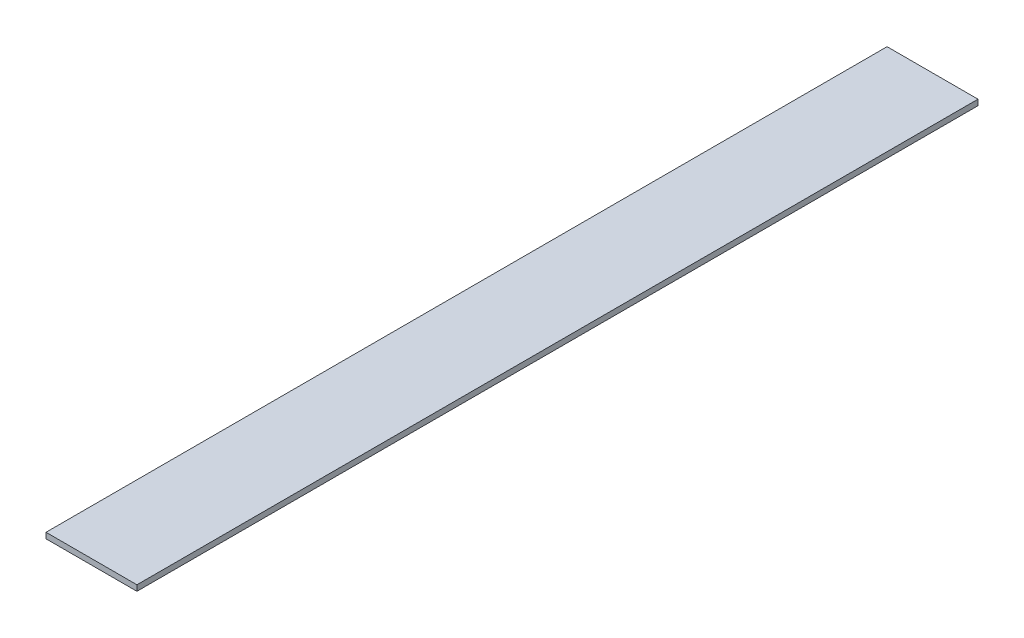
ISO-10303-21;
HEADER;
FILE_DESCRIPTION(('STEP AP214'),'2;1');
FILE_NAME('part.step','',(''),(''),'','','');
FILE_SCHEMA(('AUTOMOTIVE_DESIGN { 1 0 10303 214 1 1 1 1 }'));
ENDSEC;
DATA;
#1=APPLICATION_CONTEXT('core data for automotive mechanical design processes');
#2=APPLICATION_PROTOCOL_DEFINITION('international standard','automotive_design',2000,#1);
#3=PRODUCT_CONTEXT('',#1,'mechanical');
#4=PRODUCT('Part','Part','',(#3));
#5=PRODUCT_RELATED_PRODUCT_CATEGORY('part','',(#4));
#6=PRODUCT_DEFINITION_FORMATION('','',#4);
#7=PRODUCT_DEFINITION_CONTEXT('part definition',#1,'design');
#8=PRODUCT_DEFINITION('design','',#6,#7);
#9=PRODUCT_DEFINITION_SHAPE('','',#8);
#10=(LENGTH_UNIT() NAMED_UNIT(*) SI_UNIT(.MILLI.,.METRE.));
#11=(NAMED_UNIT(*) PLANE_ANGLE_UNIT() SI_UNIT($,.RADIAN.));
#12=(NAMED_UNIT(*) SI_UNIT($,.STERADIAN.) SOLID_ANGLE_UNIT());
#13=UNCERTAINTY_MEASURE_WITH_UNIT(LENGTH_MEASURE(1.E-05),#10,'distance_accuracy_value','');
#14=(GEOMETRIC_REPRESENTATION_CONTEXT(3) GLOBAL_UNCERTAINTY_ASSIGNED_CONTEXT((#13)) GLOBAL_UNIT_ASSIGNED_CONTEXT((#10,
#11,#12)) REPRESENTATION_CONTEXT('',''));
#15=CARTESIAN_POINT('',(0.,0.,0.));
#16=DIRECTION('',(0.,0.,1.));
#17=DIRECTION('',(1.,0.,0.));
#18=AXIS2_PLACEMENT_3D('',#15,#16,#17);
#19=CARTESIAN_POINT('',(0.,3.175,0.));
#20=DIRECTION('',(0.,1.,0.));
#21=DIRECTION('',(0.,0.,1.));
#22=AXIS2_PLACEMENT_3D('',#19,#20,#21);
#23=PLANE('',#22);
#24=DIRECTION('',(-1.,0.,0.));
#25=VECTOR('',#24,1.);
#26=CARTESIAN_POINT('',(25.4,3.175,-234.95));
#27=LINE('',#26,#25);
#28=CARTESIAN_POINT('',(-25.4,3.175,-234.95));
#29=VERTEX_POINT('',#28);
#30=CARTESIAN_POINT('',(25.4,3.175,-234.95));
#31=VERTEX_POINT('',#30);
#32=EDGE_CURVE('E67',#29,#31,#27,.F.);
#33=ORIENTED_EDGE('',*,*,#32,.F.);
#34=DIRECTION('',(0.,0.,1.));
#35=VECTOR('',#34,1.);
#36=CARTESIAN_POINT('',(-25.4,3.175,-234.95));
#37=LINE('',#36,#35);
#38=CARTESIAN_POINT('',(-25.4,3.175,234.95));
#39=VERTEX_POINT('',#38);
#40=EDGE_CURVE('E19',#39,#29,#37,.F.);
#41=ORIENTED_EDGE('',*,*,#40,.F.);
#42=DIRECTION('',(1.,0.,0.));
#43=VECTOR('',#42,1.);
#44=CARTESIAN_POINT('',(-25.4,3.175,234.95));
#45=LINE('',#44,#43);
#46=CARTESIAN_POINT('',(25.4,3.175,234.95));
#47=VERTEX_POINT('',#46);
#48=EDGE_CURVE('E57',#47,#39,#45,.F.);
#49=ORIENTED_EDGE('',*,*,#48,.F.);
#50=DIRECTION('',(0.,0.,-1.));
#51=VECTOR('',#50,1.);
#52=CARTESIAN_POINT('',(25.4,3.175,234.95));
#53=LINE('',#52,#51);
#54=EDGE_CURVE('E52',#31,#47,#53,.F.);
#55=ORIENTED_EDGE('',*,*,#54,.F.);
#56=EDGE_LOOP('',(#33,#41,#49,#55));
#57=FACE_BOUND('',#56,.T.);
#58=ADVANCED_FACE('F16',(#57),#23,.T.);
#59=CARTESIAN_POINT('',(-25.4,0.,-234.95));
#60=DIRECTION('',(-1.,0.,0.));
#61=DIRECTION('',(0.,0.,1.));
#62=AXIS2_PLACEMENT_3D('',#59,#60,#61);
#63=PLANE('',#62);
#64=DIRECTION('',(0.,1.,0.));
#65=VECTOR('',#64,1.);
#66=CARTESIAN_POINT('',(-25.4,0.,-234.95));
#67=LINE('',#66,#65);
#68=CARTESIAN_POINT('',(-25.4,0.,-234.95));
#69=VERTEX_POINT('',#68);
#70=EDGE_CURVE('E78',#69,#29,#67,.T.);
#71=ORIENTED_EDGE('',*,*,#70,.F.);
#72=DIRECTION('',(0.,0.,1.));
#73=VECTOR('',#72,1.);
#74=CARTESIAN_POINT('',(-25.4,0.,0.));
#75=LINE('',#74,#73);
#76=CARTESIAN_POINT('',(-25.4,0.,234.95));
#77=VERTEX_POINT('',#76);
#78=EDGE_CURVE('E73',#69,#77,#75,.T.);
#79=ORIENTED_EDGE('',*,*,#78,.T.);
#80=DIRECTION('',(0.,1.,0.));
#81=VECTOR('',#80,1.);
#82=CARTESIAN_POINT('',(-25.4,0.,234.95));
#83=LINE('',#82,#81);
#84=EDGE_CURVE('E62',#39,#77,#83,.F.);
#85=ORIENTED_EDGE('',*,*,#84,.F.);
#86=ORIENTED_EDGE('',*,*,#40,.T.);
#87=EDGE_LOOP('',(#71,#79,#85,#86));
#88=FACE_BOUND('',#87,.T.);
#89=ADVANCED_FACE('F72',(#88),#63,.T.);
#90=CARTESIAN_POINT('',(-25.4,0.,234.95));
#91=DIRECTION('',(0.,0.,1.));
#92=DIRECTION('',(1.,0.,0.));
#93=AXIS2_PLACEMENT_3D('',#90,#91,#92);
#94=PLANE('',#93);
#95=ORIENTED_EDGE('',*,*,#84,.T.);
#96=DIRECTION('',(1.,0.,0.));
#97=VECTOR('',#96,1.);
#98=CARTESIAN_POINT('',(0.,0.,234.95));
#99=LINE('',#98,#97);
#100=CARTESIAN_POINT('',(25.4,0.,234.95));
#101=VERTEX_POINT('',#100);
#102=EDGE_CURVE('E83',#77,#101,#99,.T.);
#103=ORIENTED_EDGE('',*,*,#102,.T.);
#104=DIRECTION('',(0.,1.,0.));
#105=VECTOR('',#104,1.);
#106=CARTESIAN_POINT('',(25.4,0.,234.95));
#107=LINE('',#106,#105);
#108=EDGE_CURVE('E64',#47,#101,#107,.F.);
#109=ORIENTED_EDGE('',*,*,#108,.F.);
#110=ORIENTED_EDGE('',*,*,#48,.T.);
#111=EDGE_LOOP('',(#95,#103,#109,#110));
#112=FACE_BOUND('',#111,.T.);
#113=ADVANCED_FACE('F59',(#112),#94,.T.);
#114=CARTESIAN_POINT('',(25.4,0.,234.95));
#115=DIRECTION('',(1.,0.,0.));
#116=DIRECTION('',(0.,0.,-1.));
#117=AXIS2_PLACEMENT_3D('',#114,#115,#116);
#118=PLANE('',#117);
#119=ORIENTED_EDGE('',*,*,#108,.T.);
#120=DIRECTION('',(0.,0.,1.));
#121=VECTOR('',#120,1.);
#122=CARTESIAN_POINT('',(25.4,0.,0.));
#123=LINE('',#122,#121);
#124=CARTESIAN_POINT('',(25.4,0.,-234.95));
#125=VERTEX_POINT('',#124);
#126=EDGE_CURVE('E25',#101,#125,#123,.F.);
#127=ORIENTED_EDGE('',*,*,#126,.T.);
#128=DIRECTION('',(0.,1.,0.));
#129=VECTOR('',#128,1.);
#130=CARTESIAN_POINT('',(25.4,0.,-234.95));
#131=LINE('',#130,#129);
#132=EDGE_CURVE('E33',#31,#125,#131,.F.);
#133=ORIENTED_EDGE('',*,*,#132,.F.);
#134=ORIENTED_EDGE('',*,*,#54,.T.);
#135=EDGE_LOOP('',(#119,#127,#133,#134));
#136=FACE_BOUND('',#135,.T.);
#137=ADVANCED_FACE('F87',(#136),#118,.T.);
#138=CARTESIAN_POINT('',(25.4,0.,-234.95));
#139=DIRECTION('',(0.,0.,-1.));
#140=DIRECTION('',(-1.,0.,0.));
#141=AXIS2_PLACEMENT_3D('',#138,#139,#140);
#142=PLANE('',#141);
#143=ORIENTED_EDGE('',*,*,#132,.T.);
#144=DIRECTION('',(1.,0.,0.));
#145=VECTOR('',#144,1.);
#146=CARTESIAN_POINT('',(0.,0.,-234.95));
#147=LINE('',#146,#145);
#148=EDGE_CURVE('E11',#125,#69,#147,.F.);
#149=ORIENTED_EDGE('',*,*,#148,.T.);
#150=ORIENTED_EDGE('',*,*,#70,.T.);
#151=ORIENTED_EDGE('',*,*,#32,.T.);
#152=EDGE_LOOP('',(#143,#149,#150,#151));
#153=FACE_BOUND('',#152,.T.);
#154=ADVANCED_FACE('F90',(#153),#142,.T.);
#155=CARTESIAN_POINT('',(0.,0.,0.));
#156=DIRECTION('',(0.,1.,0.));
#157=DIRECTION('',(0.,0.,1.));
#158=AXIS2_PLACEMENT_3D('',#155,#156,#157);
#159=PLANE('',#158);
#160=ORIENTED_EDGE('',*,*,#126,.F.);
#161=ORIENTED_EDGE('',*,*,#102,.F.);
#162=ORIENTED_EDGE('',*,*,#78,.F.);
#163=ORIENTED_EDGE('',*,*,#148,.F.);
#164=EDGE_LOOP('',(#160,#161,#162,#163));
#165=FACE_BOUND('',#164,.T.);
#166=ADVANCED_FACE('F89',(#165),#159,.F.);
#167=CLOSED_SHELL('',(#58,#89,#113,#137,#154,#166));
#168=MANIFOLD_SOLID_BREP('B1',#167);
#169=ADVANCED_BREP_SHAPE_REPRESENTATION('',(#18,#168),#14);
#170=SHAPE_DEFINITION_REPRESENTATION(#9,#169);
ENDSEC;
END-ISO-10303-21;
